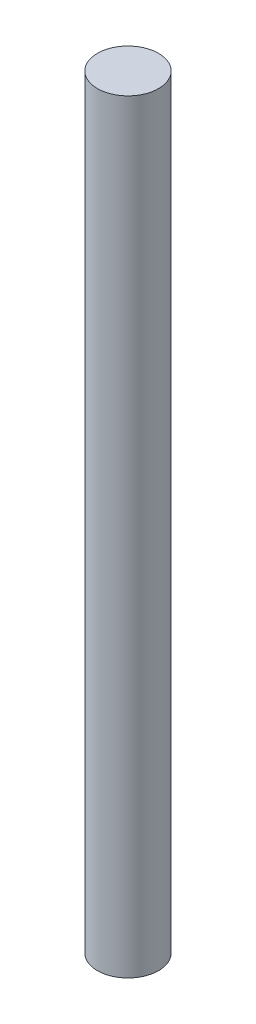
ISO-10303-21;
HEADER;
FILE_DESCRIPTION(('STEP AP214'),'2;1');
FILE_NAME('part.step','',(''),(''),'','','');
FILE_SCHEMA(('AUTOMOTIVE_DESIGN { 1 0 10303 214 1 1 1 1 }'));
ENDSEC;
DATA;
#1=APPLICATION_CONTEXT('core data for automotive mechanical design processes');
#2=APPLICATION_PROTOCOL_DEFINITION('international standard','automotive_design',2000,#1);
#3=PRODUCT_CONTEXT('',#1,'mechanical');
#4=PRODUCT('Part','Part','',(#3));
#5=PRODUCT_RELATED_PRODUCT_CATEGORY('part','',(#4));
#6=PRODUCT_DEFINITION_FORMATION('','',#4);
#7=PRODUCT_DEFINITION_CONTEXT('part definition',#1,'design');
#8=PRODUCT_DEFINITION('design','',#6,#7);
#9=PRODUCT_DEFINITION_SHAPE('','',#8);
#10=(LENGTH_UNIT() NAMED_UNIT(*) SI_UNIT(.MILLI.,.METRE.));
#11=(NAMED_UNIT(*) PLANE_ANGLE_UNIT() SI_UNIT($,.RADIAN.));
#12=(NAMED_UNIT(*) SI_UNIT($,.STERADIAN.) SOLID_ANGLE_UNIT());
#13=UNCERTAINTY_MEASURE_WITH_UNIT(LENGTH_MEASURE(1.E-05),#10,'distance_accuracy_value','');
#14=(GEOMETRIC_REPRESENTATION_CONTEXT(3) GLOBAL_UNCERTAINTY_ASSIGNED_CONTEXT((#13)) GLOBAL_UNIT_ASSIGNED_CONTEXT((#10,
#11,#12)) REPRESENTATION_CONTEXT('',''));
#15=CARTESIAN_POINT('',(0.,0.,0.));
#16=DIRECTION('',(0.,0.,1.));
#17=DIRECTION('',(1.,0.,0.));
#18=AXIS2_PLACEMENT_3D('',#15,#16,#17);
#19=CARTESIAN_POINT('',(0.,40.,0.));
#20=DIRECTION('',(0.,-1.,0.));
#21=DIRECTION('',(0.,0.,-1.));
#22=AXIS2_PLACEMENT_3D('',#19,#20,#21);
#23=CYLINDRICAL_SURFACE('',#22,1.6);
#24=CARTESIAN_POINT('',(0.,40.,0.));
#25=DIRECTION('',(0.,1.,0.));
#26=DIRECTION('',(0.,0.,1.));
#27=AXIS2_PLACEMENT_3D('',#24,#25,#26);
#28=CIRCLE('',#27,1.6);
#29=CARTESIAN_POINT('',(0.,40.,1.6));
#30=VERTEX_POINT('',#29);
#31=EDGE_CURVE('E10',#30,#30,#28,.T.);
#32=ORIENTED_EDGE('',*,*,#31,.F.);
#33=EDGE_LOOP('',(#32));
#34=FACE_BOUND('',#33,.T.);
#35=CARTESIAN_POINT('',(0.,0.,0.));
#36=DIRECTION('',(0.,1.,0.));
#37=DIRECTION('',(0.,0.,1.));
#38=AXIS2_PLACEMENT_3D('',#35,#36,#37);
#39=CIRCLE('',#38,1.6);
#40=CARTESIAN_POINT('',(0.,0.,1.6));
#41=VERTEX_POINT('',#40);
#42=EDGE_CURVE('E34',#41,#41,#39,.T.);
#43=ORIENTED_EDGE('',*,*,#42,.T.);
#44=EDGE_LOOP('',(#43));
#45=FACE_BOUND('',#44,.T.);
#46=ADVANCED_FACE('F31',(#34,#45),#23,.T.);
#47=CARTESIAN_POINT('',(0.,40.,0.));
#48=DIRECTION('',(0.,1.,0.));
#49=DIRECTION('',(0.,0.,1.));
#50=AXIS2_PLACEMENT_3D('',#47,#48,#49);
#51=PLANE('',#50);
#52=ORIENTED_EDGE('',*,*,#31,.T.);
#53=EDGE_LOOP('',(#52));
#54=FACE_BOUND('',#53,.T.);
#55=ADVANCED_FACE('F46',(#54),#51,.T.);
#56=CARTESIAN_POINT('',(0.,0.,0.));
#57=DIRECTION('',(0.,1.,0.));
#58=DIRECTION('',(0.,0.,1.));
#59=AXIS2_PLACEMENT_3D('',#56,#57,#58);
#60=PLANE('',#59);
#61=ORIENTED_EDGE('',*,*,#42,.F.);
#62=EDGE_LOOP('',(#61));
#63=FACE_BOUND('',#62,.T.);
#64=ADVANCED_FACE('F44',(#63),#60,.F.);
#65=CLOSED_SHELL('',(#46,#55,#64));
#66=MANIFOLD_SOLID_BREP('B2',#65);
#67=ADVANCED_BREP_SHAPE_REPRESENTATION('',(#18,#66),#14);
#68=SHAPE_DEFINITION_REPRESENTATION(#9,#67);
ENDSEC;
END-ISO-10303-21;
